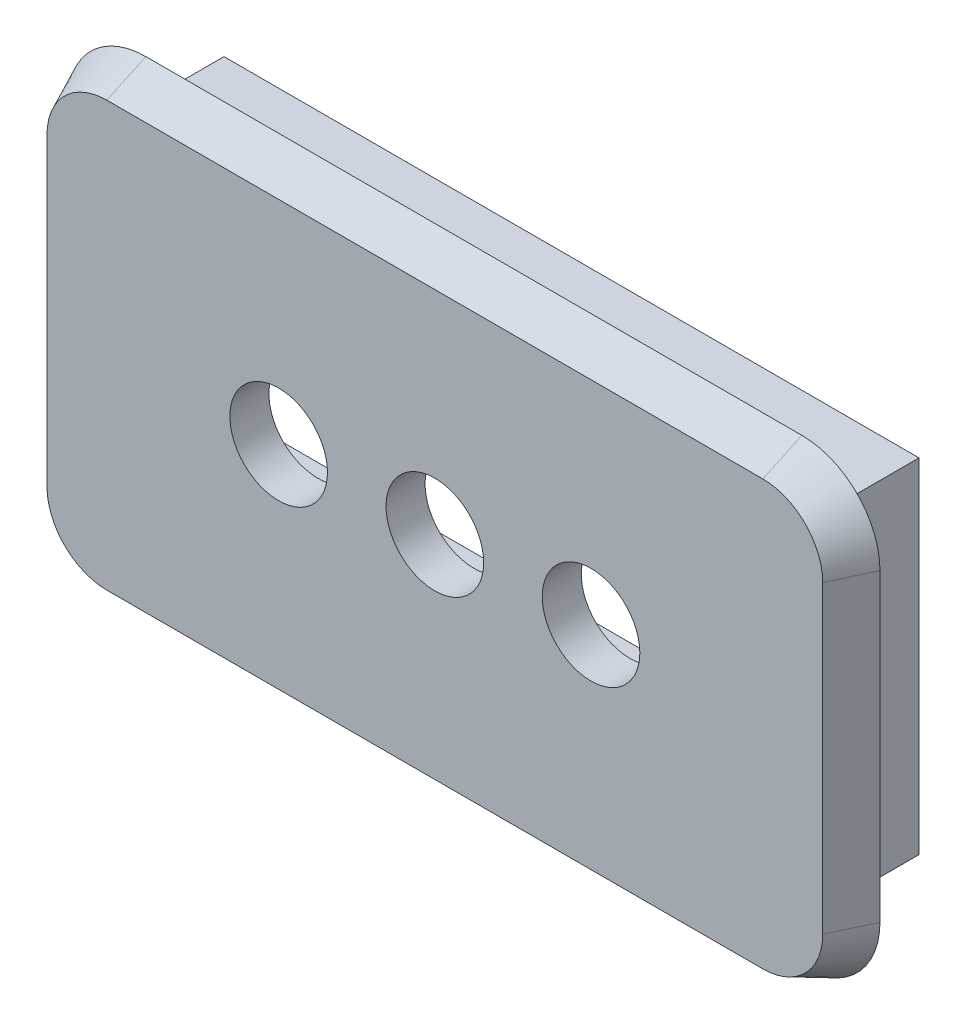
ISO-10303-21;
HEADER;
FILE_DESCRIPTION(('STEP AP214'),'2;1');
FILE_NAME('part.step','',(''),(''),'','','');
FILE_SCHEMA(('AUTOMOTIVE_DESIGN { 1 0 10303 214 1 1 1 1 }'));
ENDSEC;
DATA;
#1=APPLICATION_CONTEXT('core data for automotive mechanical design processes');
#2=APPLICATION_PROTOCOL_DEFINITION('international standard','automotive_design',2000,#1);
#3=PRODUCT_CONTEXT('',#1,'mechanical');
#4=PRODUCT('Part','Part','',(#3));
#5=PRODUCT_RELATED_PRODUCT_CATEGORY('part','',(#4));
#6=PRODUCT_DEFINITION_FORMATION('','',#4);
#7=PRODUCT_DEFINITION_CONTEXT('part definition',#1,'design');
#8=PRODUCT_DEFINITION('design','',#6,#7);
#9=PRODUCT_DEFINITION_SHAPE('','',#8);
#10=(LENGTH_UNIT() NAMED_UNIT(*) SI_UNIT(.MILLI.,.METRE.));
#11=(NAMED_UNIT(*) PLANE_ANGLE_UNIT() SI_UNIT($,.RADIAN.));
#12=(NAMED_UNIT(*) SI_UNIT($,.STERADIAN.) SOLID_ANGLE_UNIT());
#13=UNCERTAINTY_MEASURE_WITH_UNIT(LENGTH_MEASURE(1.E-05),#10,'distance_accuracy_value','');
#14=(GEOMETRIC_REPRESENTATION_CONTEXT(3) GLOBAL_UNCERTAINTY_ASSIGNED_CONTEXT((#13)) GLOBAL_UNIT_ASSIGNED_CONTEXT((#10,
#11,#12)) REPRESENTATION_CONTEXT('',''));
#15=CARTESIAN_POINT('',(0.,0.,0.));
#16=DIRECTION('',(0.,0.,1.));
#17=DIRECTION('',(1.,0.,0.));
#18=AXIS2_PLACEMENT_3D('',#15,#16,#17);
#19=CARTESIAN_POINT('',(9.33499999999989,29.9,-2.5));
#20=DIRECTION('',(0.,1.,0.));
#21=DIRECTION('',(0.,0.,1.));
#22=AXIS2_PLACEMENT_3D('',#19,#20,#21);
#23=PLANE('',#22);
#24=DIRECTION('',(-1.,0.,0.));
#25=VECTOR('',#24,1.);
#26=CARTESIAN_POINT('',(9.33499999999989,29.9,0.));
#27=LINE('',#26,#25);
#28=CARTESIAN_POINT('',(9.33499999999989,29.9,0.));
#29=VERTEX_POINT('',#28);
#30=CARTESIAN_POINT('',(-8.46500000000011,29.9,0.));
#31=VERTEX_POINT('',#30);
#32=EDGE_CURVE('E263',#29,#31,#27,.T.);
#33=ORIENTED_EDGE('',*,*,#32,.F.);
#34=DIRECTION('',(0.,0.,1.));
#35=VECTOR('',#34,1.);
#36=CARTESIAN_POINT('',(9.33499999999989,29.9,-2.5));
#37=LINE('',#36,#35);
#38=CARTESIAN_POINT('',(9.33499999999989,29.9,-2.5));
#39=VERTEX_POINT('',#38);
#40=EDGE_CURVE('E11',#39,#29,#37,.T.);
#41=ORIENTED_EDGE('',*,*,#40,.F.);
#42=DIRECTION('',(-1.,0.,0.));
#43=VECTOR('',#42,1.);
#44=CARTESIAN_POINT('',(9.33499999999989,29.9,-2.5));
#45=LINE('',#44,#43);
#46=CARTESIAN_POINT('',(-8.46500000000011,29.9,-2.5));
#47=VERTEX_POINT('',#46);
#48=EDGE_CURVE('E271',#39,#47,#45,.T.);
#49=ORIENTED_EDGE('',*,*,#48,.T.);
#50=DIRECTION('',(0.,0.,1.));
#51=VECTOR('',#50,1.);
#52=CARTESIAN_POINT('',(-8.46500000000011,29.9,-2.5));
#53=LINE('',#52,#51);
#54=EDGE_CURVE('E42',#47,#31,#53,.T.);
#55=ORIENTED_EDGE('',*,*,#54,.T.);
#56=EDGE_LOOP('',(#33,#41,#49,#55));
#57=FACE_BOUND('',#56,.T.);
#58=ADVANCED_FACE('F39',(#57),#23,.T.);
#59=CARTESIAN_POINT('',(9.33499999999988,21.1,-2.5));
#60=DIRECTION('',(1.,0.,0.));
#61=DIRECTION('',(0.,1.,0.));
#62=AXIS2_PLACEMENT_3D('',#59,#60,#61);
#63=PLANE('',#62);
#64=DIRECTION('',(0.,1.,0.));
#65=VECTOR('',#64,1.);
#66=CARTESIAN_POINT('',(9.33499999999988,21.1,0.));
#67=LINE('',#66,#65);
#68=CARTESIAN_POINT('',(9.33499999999988,21.1,0.));
#69=VERTEX_POINT('',#68);
#70=EDGE_CURVE('E274',#69,#29,#67,.T.);
#71=ORIENTED_EDGE('',*,*,#70,.F.);
#72=DIRECTION('',(0.,0.,1.));
#73=VECTOR('',#72,1.);
#74=CARTESIAN_POINT('',(9.33499999999988,21.1,-2.5));
#75=LINE('',#74,#73);
#76=CARTESIAN_POINT('',(9.33499999999988,21.1,-2.5));
#77=VERTEX_POINT('',#76);
#78=EDGE_CURVE('E47',#77,#69,#75,.T.);
#79=ORIENTED_EDGE('',*,*,#78,.F.);
#80=DIRECTION('',(0.,1.,0.));
#81=VECTOR('',#80,1.);
#82=CARTESIAN_POINT('',(9.33499999999988,21.1,-2.5));
#83=LINE('',#82,#81);
#84=EDGE_CURVE('E278',#77,#39,#83,.T.);
#85=ORIENTED_EDGE('',*,*,#84,.T.);
#86=ORIENTED_EDGE('',*,*,#40,.T.);
#87=EDGE_LOOP('',(#71,#79,#85,#86));
#88=FACE_BOUND('',#87,.T.);
#89=ADVANCED_FACE('F294',(#88),#63,.T.);
#90=CARTESIAN_POINT('',(-8.46500000000011,21.1,-2.5));
#91=DIRECTION('',(0.,-1.,0.));
#92=DIRECTION('',(0.,0.,-1.));
#93=AXIS2_PLACEMENT_3D('',#90,#91,#92);
#94=PLANE('',#93);
#95=DIRECTION('',(1.,0.,0.));
#96=VECTOR('',#95,1.);
#97=CARTESIAN_POINT('',(-8.46500000000011,21.1,0.));
#98=LINE('',#97,#96);
#99=CARTESIAN_POINT('',(-8.46500000000011,21.1,0.));
#100=VERTEX_POINT('',#99);
#101=EDGE_CURVE('E286',#100,#69,#98,.T.);
#102=ORIENTED_EDGE('',*,*,#101,.F.);
#103=DIRECTION('',(0.,0.,1.));
#104=VECTOR('',#103,1.);
#105=CARTESIAN_POINT('',(-8.46500000000011,21.1,-2.5));
#106=LINE('',#105,#104);
#107=CARTESIAN_POINT('',(-8.46500000000011,21.1,-2.5));
#108=VERTEX_POINT('',#107);
#109=EDGE_CURVE('E291',#108,#100,#106,.T.);
#110=ORIENTED_EDGE('',*,*,#109,.F.);
#111=DIRECTION('',(1.,0.,0.));
#112=VECTOR('',#111,1.);
#113=CARTESIAN_POINT('',(-8.46500000000011,21.1,-2.5));
#114=LINE('',#113,#112);
#115=EDGE_CURVE('E276',#108,#77,#114,.T.);
#116=ORIENTED_EDGE('',*,*,#115,.T.);
#117=ORIENTED_EDGE('',*,*,#78,.T.);
#118=EDGE_LOOP('',(#102,#110,#116,#117));
#119=FACE_BOUND('',#118,.T.);
#120=ADVANCED_FACE('F299',(#119),#94,.T.);
#121=CARTESIAN_POINT('',(-8.46500000000011,29.9,-2.5));
#122=DIRECTION('',(-1.,0.,0.));
#123=DIRECTION('',(0.,-1.,0.));
#124=AXIS2_PLACEMENT_3D('',#121,#122,#123);
#125=PLANE('',#124);
#126=DIRECTION('',(0.,-1.,0.));
#127=VECTOR('',#126,1.);
#128=CARTESIAN_POINT('',(-8.46500000000011,29.9,0.));
#129=LINE('',#128,#127);
#130=EDGE_CURVE('E283',#31,#100,#129,.T.);
#131=ORIENTED_EDGE('',*,*,#130,.F.);
#132=ORIENTED_EDGE('',*,*,#54,.F.);
#133=DIRECTION('',(0.,-1.,0.));
#134=VECTOR('',#133,1.);
#135=CARTESIAN_POINT('',(-8.46500000000011,29.9,-2.5));
#136=LINE('',#135,#134);
#137=EDGE_CURVE('E273',#47,#108,#136,.T.);
#138=ORIENTED_EDGE('',*,*,#137,.T.);
#139=ORIENTED_EDGE('',*,*,#109,.T.);
#140=EDGE_LOOP('',(#131,#132,#138,#139));
#141=FACE_BOUND('',#140,.T.);
#142=ADVANCED_FACE('F292',(#141),#125,.T.);
#143=CARTESIAN_POINT('',(0.,0.,-2.5));
#144=DIRECTION('',(0.,0.,1.));
#145=DIRECTION('',(1.,0.,0.));
#146=AXIS2_PLACEMENT_3D('',#143,#144,#145);
#147=PLANE('',#146);
#148=DIRECTION('',(0.,1.,0.));
#149=VECTOR('',#148,1.);
#150=CARTESIAN_POINT('',(8.33499999999988,22.1,-2.5));
#151=LINE('',#150,#149);
#152=CARTESIAN_POINT('',(8.33499999999988,22.1,-2.5));
#153=VERTEX_POINT('',#152);
#154=CARTESIAN_POINT('',(8.33499999999988,28.9,-2.5));
#155=VERTEX_POINT('',#154);
#156=EDGE_CURVE('E246',#153,#155,#151,.T.);
#157=ORIENTED_EDGE('',*,*,#156,.T.);
#158=DIRECTION('',(-1.,0.,0.));
#159=VECTOR('',#158,1.);
#160=CARTESIAN_POINT('',(8.33499999999988,28.9,-2.5));
#161=LINE('',#160,#159);
#162=CARTESIAN_POINT('',(-7.46500000000011,28.9,-2.5));
#163=VERTEX_POINT('',#162);
#164=EDGE_CURVE('E238',#155,#163,#161,.T.);
#165=ORIENTED_EDGE('',*,*,#164,.T.);
#166=DIRECTION('',(0.,-1.,0.));
#167=VECTOR('',#166,1.);
#168=CARTESIAN_POINT('',(-7.46500000000011,28.9,-2.5));
#169=LINE('',#168,#167);
#170=CARTESIAN_POINT('',(-7.46500000000011,22.1,-2.5));
#171=VERTEX_POINT('',#170);
#172=EDGE_CURVE('E241',#163,#171,#169,.T.);
#173=ORIENTED_EDGE('',*,*,#172,.T.);
#174=DIRECTION('',(1.,0.,0.));
#175=VECTOR('',#174,1.);
#176=CARTESIAN_POINT('',(-7.46500000000011,22.1,-2.5));
#177=LINE('',#176,#175);
#178=EDGE_CURVE('E55',#171,#153,#177,.T.);
#179=ORIENTED_EDGE('',*,*,#178,.T.);
#180=EDGE_LOOP('',(#157,#165,#173,#179));
#181=FACE_BOUND('',#180,.T.);
#182=ORIENTED_EDGE('',*,*,#48,.F.);
#183=ORIENTED_EDGE('',*,*,#84,.F.);
#184=ORIENTED_EDGE('',*,*,#115,.F.);
#185=ORIENTED_EDGE('',*,*,#137,.F.);
#186=EDGE_LOOP('',(#182,#183,#184,#185));
#187=FACE_BOUND('',#186,.T.);
#188=ADVANCED_FACE('F298',(#181,#187),#147,.F.);
#189=CARTESIAN_POINT('',(8.33499999999988,28.9,-2.5));
#190=DIRECTION('',(0.,1.,0.));
#191=DIRECTION('',(-1.,0.,0.));
#192=AXIS2_PLACEMENT_3D('',#189,#190,#191);
#193=PLANE('',#192);
#194=DIRECTION('',(-1.,0.,0.));
#195=VECTOR('',#194,1.);
#196=CARTESIAN_POINT('',(8.33499999999988,28.9,0.));
#197=LINE('',#196,#195);
#198=CARTESIAN_POINT('',(8.33499999999988,28.9,0.));
#199=VERTEX_POINT('',#198);
#200=CARTESIAN_POINT('',(-7.46500000000011,28.9,0.));
#201=VERTEX_POINT('',#200);
#202=EDGE_CURVE('E181',#199,#201,#197,.T.);
#203=ORIENTED_EDGE('',*,*,#202,.T.);
#204=DIRECTION('',(0.,0.,1.));
#205=VECTOR('',#204,1.);
#206=CARTESIAN_POINT('',(-7.46500000000011,28.9,-2.5));
#207=LINE('',#206,#205);
#208=EDGE_CURVE('E249',#163,#201,#207,.T.);
#209=ORIENTED_EDGE('',*,*,#208,.F.);
#210=ORIENTED_EDGE('',*,*,#164,.F.);
#211=DIRECTION('',(0.,0.,1.));
#212=VECTOR('',#211,1.);
#213=CARTESIAN_POINT('',(8.33499999999988,28.9,-2.5));
#214=LINE('',#213,#212);
#215=EDGE_CURVE('E260',#155,#199,#214,.T.);
#216=ORIENTED_EDGE('',*,*,#215,.T.);
#217=EDGE_LOOP('',(#203,#209,#210,#216));
#218=FACE_BOUND('',#217,.T.);
#219=ADVANCED_FACE('F335',(#218),#193,.F.);
#220=CARTESIAN_POINT('',(8.33499999999988,22.1,-2.5));
#221=DIRECTION('',(1.,0.,0.));
#222=DIRECTION('',(0.,1.,0.));
#223=AXIS2_PLACEMENT_3D('',#220,#221,#222);
#224=PLANE('',#223);
#225=DIRECTION('',(0.,1.,0.));
#226=VECTOR('',#225,1.);
#227=CARTESIAN_POINT('',(8.33499999999988,22.1,0.));
#228=LINE('',#227,#226);
#229=CARTESIAN_POINT('',(8.33499999999988,22.1,0.));
#230=VERTEX_POINT('',#229);
#231=EDGE_CURVE('E242',#230,#199,#228,.T.);
#232=ORIENTED_EDGE('',*,*,#231,.T.);
#233=ORIENTED_EDGE('',*,*,#215,.F.);
#234=ORIENTED_EDGE('',*,*,#156,.F.);
#235=DIRECTION('',(0.,0.,1.));
#236=VECTOR('',#235,1.);
#237=CARTESIAN_POINT('',(8.33499999999988,22.1,-2.5));
#238=LINE('',#237,#236);
#239=EDGE_CURVE('E264',#153,#230,#238,.T.);
#240=ORIENTED_EDGE('',*,*,#239,.T.);
#241=EDGE_LOOP('',(#232,#233,#234,#240));
#242=FACE_BOUND('',#241,.T.);
#243=ADVANCED_FACE('F340',(#242),#224,.F.);
#244=CARTESIAN_POINT('',(-7.46500000000011,22.1,-2.5));
#245=DIRECTION('',(0.,-1.,0.));
#246=DIRECTION('',(0.,0.,-1.));
#247=AXIS2_PLACEMENT_3D('',#244,#245,#246);
#248=PLANE('',#247);
#249=DIRECTION('',(1.,0.,0.));
#250=VECTOR('',#249,1.);
#251=CARTESIAN_POINT('',(-7.46500000000011,22.1,0.));
#252=LINE('',#251,#250);
#253=CARTESIAN_POINT('',(-7.46500000000011,22.1,0.));
#254=VERTEX_POINT('',#253);
#255=EDGE_CURVE('E255',#254,#230,#252,.T.);
#256=ORIENTED_EDGE('',*,*,#255,.T.);
#257=ORIENTED_EDGE('',*,*,#239,.F.);
#258=ORIENTED_EDGE('',*,*,#178,.F.);
#259=DIRECTION('',(0.,0.,1.));
#260=VECTOR('',#259,1.);
#261=CARTESIAN_POINT('',(-7.46500000000011,22.1,-2.5));
#262=LINE('',#261,#260);
#263=EDGE_CURVE('E267',#171,#254,#262,.T.);
#264=ORIENTED_EDGE('',*,*,#263,.T.);
#265=EDGE_LOOP('',(#256,#257,#258,#264));
#266=FACE_BOUND('',#265,.T.);
#267=ADVANCED_FACE('F351',(#266),#248,.F.);
#268=CARTESIAN_POINT('',(-7.46500000000011,28.9,-2.5));
#269=DIRECTION('',(-1.,0.,0.));
#270=DIRECTION('',(0.,0.,1.));
#271=AXIS2_PLACEMENT_3D('',#268,#269,#270);
#272=PLANE('',#271);
#273=DIRECTION('',(0.,-1.,0.));
#274=VECTOR('',#273,1.);
#275=CARTESIAN_POINT('',(-7.46500000000011,28.9,0.));
#276=LINE('',#275,#274);
#277=EDGE_CURVE('E252',#201,#254,#276,.T.);
#278=ORIENTED_EDGE('',*,*,#277,.T.);
#279=ORIENTED_EDGE('',*,*,#263,.F.);
#280=ORIENTED_EDGE('',*,*,#172,.F.);
#281=ORIENTED_EDGE('',*,*,#208,.T.);
#282=EDGE_LOOP('',(#278,#279,#280,#281));
#283=FACE_BOUND('',#282,.T.);
#284=ADVANCED_FACE('F362',(#283),#272,.F.);
#285=CARTESIAN_POINT('',(8.83499999999989,29.4,1.));
#286=DIRECTION('',(0.,0.,1.));
#287=DIRECTION('',(1.,0.,0.));
#288=AXIS2_PLACEMENT_3D('',#285,#286,#287);
#289=PLANE('',#288);
#290=CARTESIAN_POINT('',(4.43499999999989,25.5,1.));
#291=DIRECTION('',(0.,0.,1.));
#292=DIRECTION('',(1.,0.,0.));
#293=AXIS2_PLACEMENT_3D('',#290,#291,#292);
#294=CIRCLE('',#293,1.25);
#295=CARTESIAN_POINT('',(5.68499999999989,25.5,1.));
#296=VERTEX_POINT('',#295);
#297=EDGE_CURVE('E564',#296,#296,#294,.T.);
#298=ORIENTED_EDGE('',*,*,#297,.F.);
#299=EDGE_LOOP('',(#298));
#300=FACE_BOUND('',#299,.T.);
#301=CARTESIAN_POINT('',(-3.56500000000011,25.5,1.));
#302=DIRECTION('',(0.,0.,1.));
#303=DIRECTION('',(1.,0.,0.));
#304=AXIS2_PLACEMENT_3D('',#301,#302,#303);
#305=CIRCLE('',#304,1.25);
#306=CARTESIAN_POINT('',(-2.31500000000011,25.5,1.));
#307=VERTEX_POINT('',#306);
#308=EDGE_CURVE('E572',#307,#307,#305,.T.);
#309=ORIENTED_EDGE('',*,*,#308,.F.);
#310=EDGE_LOOP('',(#309));
#311=FACE_BOUND('',#310,.T.);
#312=CARTESIAN_POINT('',(0.434999999999888,25.5,1.));
#313=DIRECTION('',(0.,0.,1.));
#314=DIRECTION('',(1.,0.,0.));
#315=AXIS2_PLACEMENT_3D('',#312,#313,#314);
#316=CIRCLE('',#315,1.25);
#317=CARTESIAN_POINT('',(1.68499999999989,25.5,1.));
#318=VERTEX_POINT('',#317);
#319=EDGE_CURVE('E191',#318,#318,#316,.T.);
#320=ORIENTED_EDGE('',*,*,#319,.F.);
#321=EDGE_LOOP('',(#320));
#322=FACE_BOUND('',#321,.T.);
#323=CARTESIAN_POINT('',(8.83499999999989,29.4,1.));
#324=DIRECTION('',(0.,0.,1.));
#325=DIRECTION('',(1.,0.,0.));
#326=AXIS2_PLACEMENT_3D('',#323,#324,#325);
#327=CIRCLE('',#326,1.533692341845);
#328=CARTESIAN_POINT('',(10.3686923418449,29.4,1.));
#329=VERTEX_POINT('',#328);
#330=CARTESIAN_POINT('',(8.83499999999989,30.933692341845,1.));
#331=VERTEX_POINT('',#330);
#332=EDGE_CURVE('E205',#329,#331,#327,.T.);
#333=ORIENTED_EDGE('',*,*,#332,.T.);
#334=DIRECTION('',(1.,0.,0.));
#335=VECTOR('',#334,1.);
#336=CARTESIAN_POINT('',(8.83499999999989,30.933692341845,1.));
#337=LINE('',#336,#335);
#338=CARTESIAN_POINT('',(-7.96500000000011,30.933692341845,1.));
#339=VERTEX_POINT('',#338);
#340=EDGE_CURVE('E177',#331,#339,#337,.F.);
#341=ORIENTED_EDGE('',*,*,#340,.T.);
#342=CARTESIAN_POINT('',(-7.96500000000011,29.4,1.));
#343=DIRECTION('',(0.,0.,1.));
#344=DIRECTION('',(1.,0.,0.));
#345=AXIS2_PLACEMENT_3D('',#342,#343,#344);
#346=CIRCLE('',#345,1.533692341845);
#347=CARTESIAN_POINT('',(-9.49869234184511,29.4,1.));
#348=VERTEX_POINT('',#347);
#349=EDGE_CURVE('E227',#339,#348,#346,.T.);
#350=ORIENTED_EDGE('',*,*,#349,.T.);
#351=DIRECTION('',(0.,1.,0.));
#352=VECTOR('',#351,1.);
#353=CARTESIAN_POINT('',(-9.49869234184511,29.4,1.));
#354=LINE('',#353,#352);
#355=CARTESIAN_POINT('',(-9.49869234184511,21.6,1.));
#356=VERTEX_POINT('',#355);
#357=EDGE_CURVE('E229',#348,#356,#354,.F.);
#358=ORIENTED_EDGE('',*,*,#357,.T.);
#359=CARTESIAN_POINT('',(-7.96500000000011,21.6,1.));
#360=DIRECTION('',(0.,0.,1.));
#361=DIRECTION('',(1.,0.,0.));
#362=AXIS2_PLACEMENT_3D('',#359,#360,#361);
#363=CIRCLE('',#362,1.533692341845);
#364=CARTESIAN_POINT('',(-7.96500000000009,20.066307658155,1.));
#365=VERTEX_POINT('',#364);
#366=EDGE_CURVE('E231',#356,#365,#363,.T.);
#367=ORIENTED_EDGE('',*,*,#366,.T.);
#368=DIRECTION('',(-1.,0.,0.));
#369=VECTOR('',#368,1.);
#370=CARTESIAN_POINT('',(-7.96500000000009,20.066307658155,1.));
#371=LINE('',#370,#369);
#372=CARTESIAN_POINT('',(8.83499999999987,20.066307658155,1.));
#373=VERTEX_POINT('',#372);
#374=EDGE_CURVE('E233',#365,#373,#371,.F.);
#375=ORIENTED_EDGE('',*,*,#374,.T.);
#376=CARTESIAN_POINT('',(8.83499999999988,21.6,1.));
#377=DIRECTION('',(0.,0.,1.));
#378=DIRECTION('',(1.,0.,0.));
#379=AXIS2_PLACEMENT_3D('',#376,#377,#378);
#380=CIRCLE('',#379,1.533692341845);
#381=CARTESIAN_POINT('',(10.3686923418449,21.6,1.));
#382=VERTEX_POINT('',#381);
#383=EDGE_CURVE('E235',#373,#382,#380,.T.);
#384=ORIENTED_EDGE('',*,*,#383,.T.);
#385=DIRECTION('',(0.,-1.,0.));
#386=VECTOR('',#385,1.);
#387=CARTESIAN_POINT('',(10.3686923418449,21.6,1.));
#388=LINE('',#387,#386);
#389=EDGE_CURVE('E209',#382,#329,#388,.F.);
#390=ORIENTED_EDGE('',*,*,#389,.T.);
#391=EDGE_LOOP('',(#333,#341,#350,#358,#367,#375,#384,#390));
#392=FACE_BOUND('',#391,.T.);
#393=ADVANCED_FACE('F372',(#300,#311,#322,#392),#289,.T.);
#394=CARTESIAN_POINT('',(10.8349999999999,21.6,0.));
#395=DIRECTION('',(0.90630778703665,0.,0.4226182617407));
#396=DIRECTION('',(0.4226182617407,0.,-0.90630778703665));
#397=AXIS2_PLACEMENT_3D('',#394,#395,#396);
#398=PLANE('',#397);
#399=DIRECTION('',(0.,1.,0.));
#400=VECTOR('',#399,1.);
#401=CARTESIAN_POINT('',(10.8349999999999,21.6,0.));
#402=LINE('',#401,#400);
#403=CARTESIAN_POINT('',(10.8349999999999,21.6,0.));
#404=VERTEX_POINT('',#403);
#405=CARTESIAN_POINT('',(10.8349999999999,29.4,0.));
#406=VERTEX_POINT('',#405);
#407=EDGE_CURVE('E204',#404,#406,#402,.T.);
#408=ORIENTED_EDGE('',*,*,#407,.T.);
#409=DIRECTION('',(0.4226182617407,0.,-0.90630778703665));
#410=VECTOR('',#409,1.);
#411=CARTESIAN_POINT('',(10.8349999999999,29.4,0.));
#412=LINE('',#411,#410);
#413=EDGE_CURVE('E187',#329,#406,#412,.T.);
#414=ORIENTED_EDGE('',*,*,#413,.F.);
#415=ORIENTED_EDGE('',*,*,#389,.F.);
#416=DIRECTION('',(0.4226182617407,0.,-0.90630778703665));
#417=VECTOR('',#416,1.);
#418=CARTESIAN_POINT('',(10.8349999999999,21.6,0.));
#419=LINE('',#418,#417);
#420=EDGE_CURVE('E208',#382,#404,#419,.T.);
#421=ORIENTED_EDGE('',*,*,#420,.T.);
#422=EDGE_LOOP('',(#408,#414,#415,#421));
#423=FACE_BOUND('',#422,.T.);
#424=ADVANCED_FACE('F381',(#423),#398,.T.);
#425=CARTESIAN_POINT('',(8.83499999999988,21.6,0.));
#426=DIRECTION('',(0.,0.,-1.));
#427=DIRECTION('',(-1.,0.,0.));
#428=AXIS2_PLACEMENT_3D('',#425,#426,#427);
#429=CONICAL_SURFACE('',#428,2.,0.436332312998583);
#430=CARTESIAN_POINT('',(8.83499999999988,21.6,0.));
#431=DIRECTION('',(0.,0.,1.));
#432=DIRECTION('',(-1.,0.,0.));
#433=AXIS2_PLACEMENT_3D('',#430,#431,#432);
#434=CIRCLE('',#433,2.);
#435=CARTESIAN_POINT('',(8.83499999999987,19.6,0.));
#436=VERTEX_POINT('',#435);
#437=EDGE_CURVE('E202',#436,#404,#434,.T.);
#438=ORIENTED_EDGE('',*,*,#437,.T.);
#439=ORIENTED_EDGE('',*,*,#420,.F.);
#440=ORIENTED_EDGE('',*,*,#383,.F.);
#441=DIRECTION('',(0.,-0.4226182617407,-0.90630778703665));
#442=VECTOR('',#441,1.);
#443=CARTESIAN_POINT('',(8.83499999999987,19.6,0.));
#444=LINE('',#443,#442);
#445=EDGE_CURVE('E212',#373,#436,#444,.T.);
#446=ORIENTED_EDGE('',*,*,#445,.T.);
#447=EDGE_LOOP('',(#438,#439,#440,#446));
#448=FACE_BOUND('',#447,.T.);
#449=ADVANCED_FACE('F386',(#448),#429,.T.);
#450=CARTESIAN_POINT('',(-7.96500000000009,19.6,0.));
#451=DIRECTION('',(0.,-0.90630778703665,0.4226182617407));
#452=DIRECTION('',(0.,-0.4226182617407,-0.90630778703665));
#453=AXIS2_PLACEMENT_3D('',#450,#451,#452);
#454=PLANE('',#453);
#455=DIRECTION('',(1.,0.,0.));
#456=VECTOR('',#455,1.);
#457=CARTESIAN_POINT('',(-7.96500000000009,19.6,0.));
#458=LINE('',#457,#456);
#459=CARTESIAN_POINT('',(-7.96500000000009,19.6,0.));
#460=VERTEX_POINT('',#459);
#461=EDGE_CURVE('E200',#460,#436,#458,.T.);
#462=ORIENTED_EDGE('',*,*,#461,.T.);
#463=ORIENTED_EDGE('',*,*,#445,.F.);
#464=ORIENTED_EDGE('',*,*,#374,.F.);
#465=DIRECTION('',(0.,-0.4226182617407,-0.90630778703665));
#466=VECTOR('',#465,1.);
#467=CARTESIAN_POINT('',(-7.96500000000009,19.6,0.));
#468=LINE('',#467,#466);
#469=EDGE_CURVE('E215',#365,#460,#468,.T.);
#470=ORIENTED_EDGE('',*,*,#469,.T.);
#471=EDGE_LOOP('',(#462,#463,#464,#470));
#472=FACE_BOUND('',#471,.T.);
#473=ADVANCED_FACE('F397',(#472),#454,.T.);
#474=CARTESIAN_POINT('',(-7.96500000000011,21.6,0.));
#475=DIRECTION('',(0.,0.,-1.));
#476=DIRECTION('',(-1.,0.,0.));
#477=AXIS2_PLACEMENT_3D('',#474,#475,#476);
#478=CONICAL_SURFACE('',#477,2.,0.436332312998583);
#479=CARTESIAN_POINT('',(-7.96500000000011,21.6,0.));
#480=DIRECTION('',(0.,0.,1.));
#481=DIRECTION('',(-1.,0.,0.));
#482=AXIS2_PLACEMENT_3D('',#479,#480,#481);
#483=CIRCLE('',#482,2.);
#484=CARTESIAN_POINT('',(-9.96500000000011,21.6,0.));
#485=VERTEX_POINT('',#484);
#486=EDGE_CURVE('E198',#485,#460,#483,.T.);
#487=ORIENTED_EDGE('',*,*,#486,.T.);
#488=ORIENTED_EDGE('',*,*,#469,.F.);
#489=ORIENTED_EDGE('',*,*,#366,.F.);
#490=DIRECTION('',(-0.4226182617407,0.,-0.90630778703665));
#491=VECTOR('',#490,1.);
#492=CARTESIAN_POINT('',(-9.96500000000011,21.6,0.));
#493=LINE('',#492,#491);
#494=EDGE_CURVE('E218',#356,#485,#493,.T.);
#495=ORIENTED_EDGE('',*,*,#494,.T.);
#496=EDGE_LOOP('',(#487,#488,#489,#495));
#497=FACE_BOUND('',#496,.T.);
#498=ADVANCED_FACE('F408',(#497),#478,.T.);
#499=CARTESIAN_POINT('',(-9.96500000000011,29.4,0.));
#500=DIRECTION('',(-0.90630778703665,0.,0.4226182617407));
#501=DIRECTION('',(0.4226182617407,0.,0.90630778703665));
#502=AXIS2_PLACEMENT_3D('',#499,#500,#501);
#503=PLANE('',#502);
#504=DIRECTION('',(0.,-1.,0.));
#505=VECTOR('',#504,1.);
#506=CARTESIAN_POINT('',(-9.96500000000011,29.4,0.));
#507=LINE('',#506,#505);
#508=CARTESIAN_POINT('',(-9.96500000000011,29.4,0.));
#509=VERTEX_POINT('',#508);
#510=EDGE_CURVE('E196',#509,#485,#507,.T.);
#511=ORIENTED_EDGE('',*,*,#510,.T.);
#512=ORIENTED_EDGE('',*,*,#494,.F.);
#513=ORIENTED_EDGE('',*,*,#357,.F.);
#514=DIRECTION('',(-0.4226182617407,0.,-0.90630778703665));
#515=VECTOR('',#514,1.);
#516=CARTESIAN_POINT('',(-9.96500000000011,29.4,0.));
#517=LINE('',#516,#515);
#518=EDGE_CURVE('E221',#348,#509,#517,.T.);
#519=ORIENTED_EDGE('',*,*,#518,.T.);
#520=EDGE_LOOP('',(#511,#512,#513,#519));
#521=FACE_BOUND('',#520,.T.);
#522=ADVANCED_FACE('F419',(#521),#503,.T.);
#523=CARTESIAN_POINT('',(-7.96500000000011,29.4,0.));
#524=DIRECTION('',(0.,0.,-1.));
#525=DIRECTION('',(-1.,0.,0.));
#526=AXIS2_PLACEMENT_3D('',#523,#524,#525);
#527=CONICAL_SURFACE('',#526,2.,0.436332312998583);
#528=CARTESIAN_POINT('',(-7.96500000000011,29.4,0.));
#529=DIRECTION('',(0.,0.,1.));
#530=DIRECTION('',(-1.,0.,0.));
#531=AXIS2_PLACEMENT_3D('',#528,#529,#530);
#532=CIRCLE('',#531,2.);
#533=CARTESIAN_POINT('',(-7.96500000000011,31.4,0.));
#534=VERTEX_POINT('',#533);
#535=EDGE_CURVE('E169',#534,#509,#532,.T.);
#536=ORIENTED_EDGE('',*,*,#535,.T.);
#537=ORIENTED_EDGE('',*,*,#518,.F.);
#538=ORIENTED_EDGE('',*,*,#349,.F.);
#539=DIRECTION('',(0.,0.4226182617407,-0.90630778703665));
#540=VECTOR('',#539,1.);
#541=CARTESIAN_POINT('',(-7.96500000000011,31.4,0.));
#542=LINE('',#541,#540);
#543=EDGE_CURVE('E182',#339,#534,#542,.T.);
#544=ORIENTED_EDGE('',*,*,#543,.T.);
#545=EDGE_LOOP('',(#536,#537,#538,#544));
#546=FACE_BOUND('',#545,.T.);
#547=ADVANCED_FACE('F430',(#546),#527,.T.);
#548=CARTESIAN_POINT('',(8.83499999999989,31.4,0.));
#549=DIRECTION('',(0.,0.90630778703665,0.4226182617407));
#550=DIRECTION('',(0.,-0.4226182617407,0.90630778703665));
#551=AXIS2_PLACEMENT_3D('',#548,#549,#550);
#552=PLANE('',#551);
#553=DIRECTION('',(-1.,0.,0.));
#554=VECTOR('',#553,1.);
#555=CARTESIAN_POINT('',(8.83499999999989,31.4,0.));
#556=LINE('',#555,#554);
#557=CARTESIAN_POINT('',(8.83499999999989,31.4,0.));
#558=VERTEX_POINT('',#557);
#559=EDGE_CURVE('E161',#558,#534,#556,.T.);
#560=ORIENTED_EDGE('',*,*,#559,.T.);
#561=ORIENTED_EDGE('',*,*,#543,.F.);
#562=ORIENTED_EDGE('',*,*,#340,.F.);
#563=DIRECTION('',(0.,0.4226182617407,-0.90630778703665));
#564=VECTOR('',#563,1.);
#565=CARTESIAN_POINT('',(8.83499999999989,31.4,0.));
#566=LINE('',#565,#564);
#567=EDGE_CURVE('E175',#331,#558,#566,.T.);
#568=ORIENTED_EDGE('',*,*,#567,.T.);
#569=EDGE_LOOP('',(#560,#561,#562,#568));
#570=FACE_BOUND('',#569,.T.);
#571=ADVANCED_FACE('F176',(#570),#552,.T.);
#572=CARTESIAN_POINT('',(8.83499999999989,29.4,0.));
#573=DIRECTION('',(0.,0.,-1.));
#574=DIRECTION('',(1.,0.,0.));
#575=AXIS2_PLACEMENT_3D('',#572,#573,#574);
#576=CONICAL_SURFACE('',#575,2.,0.436332312998583);
#577=CARTESIAN_POINT('',(8.83499999999989,29.4,0.));
#578=DIRECTION('',(0.,0.,1.));
#579=DIRECTION('',(1.,0.,0.));
#580=AXIS2_PLACEMENT_3D('',#577,#578,#579);
#581=CIRCLE('',#580,2.);
#582=EDGE_CURVE('E167',#406,#558,#581,.T.);
#583=ORIENTED_EDGE('',*,*,#582,.T.);
#584=ORIENTED_EDGE('',*,*,#567,.F.);
#585=ORIENTED_EDGE('',*,*,#332,.F.);
#586=ORIENTED_EDGE('',*,*,#413,.T.);
#587=EDGE_LOOP('',(#583,#584,#585,#586));
#588=FACE_BOUND('',#587,.T.);
#589=ADVANCED_FACE('F185',(#588),#576,.T.);
#590=CARTESIAN_POINT('',(8.83499999999989,29.4,0.));
#591=DIRECTION('',(0.,0.,1.));
#592=DIRECTION('',(1.,0.,0.));
#593=AXIS2_PLACEMENT_3D('',#590,#591,#592);
#594=PLANE('',#593);
#595=ORIENTED_EDGE('',*,*,#582,.F.);
#596=ORIENTED_EDGE('',*,*,#407,.F.);
#597=ORIENTED_EDGE('',*,*,#437,.F.);
#598=ORIENTED_EDGE('',*,*,#461,.F.);
#599=ORIENTED_EDGE('',*,*,#486,.F.);
#600=ORIENTED_EDGE('',*,*,#510,.F.);
#601=ORIENTED_EDGE('',*,*,#535,.F.);
#602=ORIENTED_EDGE('',*,*,#559,.F.);
#603=EDGE_LOOP('',(#595,#596,#597,#598,#599,#600,#601,#602));
#604=FACE_BOUND('',#603,.T.);
#605=ORIENTED_EDGE('',*,*,#70,.T.);
#606=ORIENTED_EDGE('',*,*,#32,.T.);
#607=ORIENTED_EDGE('',*,*,#130,.T.);
#608=ORIENTED_EDGE('',*,*,#101,.T.);
#609=EDGE_LOOP('',(#605,#606,#607,#608));
#610=FACE_BOUND('',#609,.T.);
#611=ADVANCED_FACE('F163',(#604,#610),#594,.F.);
#612=CARTESIAN_POINT('',(4.43499999999989,25.5,0.));
#613=DIRECTION('',(0.,0.,1.));
#614=DIRECTION('',(1.,0.,0.));
#615=AXIS2_PLACEMENT_3D('',#612,#613,#614);
#616=CIRCLE('',#615,1.25);
#617=CARTESIAN_POINT('',(5.68499999999989,25.5,0.));
#618=VERTEX_POINT('',#617);
#619=EDGE_CURVE('E567',#618,#618,#616,.F.);
#620=ORIENTED_EDGE('',*,*,#619,.F.);
#621=EDGE_LOOP('',(#620));
#622=FACE_BOUND('',#621,.T.);
#623=CARTESIAN_POINT('',(-3.56500000000011,25.5,0.));
#624=DIRECTION('',(0.,0.,1.));
#625=DIRECTION('',(1.,0.,0.));
#626=AXIS2_PLACEMENT_3D('',#623,#624,#625);
#627=CIRCLE('',#626,1.25);
#628=CARTESIAN_POINT('',(-2.31500000000011,25.5,0.));
#629=VERTEX_POINT('',#628);
#630=EDGE_CURVE('E569',#629,#629,#627,.F.);
#631=ORIENTED_EDGE('',*,*,#630,.F.);
#632=EDGE_LOOP('',(#631));
#633=FACE_BOUND('',#632,.T.);
#634=CARTESIAN_POINT('',(0.434999999999888,25.5,0.));
#635=DIRECTION('',(0.,0.,1.));
#636=DIRECTION('',(1.,0.,0.));
#637=AXIS2_PLACEMENT_3D('',#634,#635,#636);
#638=CIRCLE('',#637,1.25);
#639=CARTESIAN_POINT('',(1.68499999999989,25.5,0.));
#640=VERTEX_POINT('',#639);
#641=EDGE_CURVE('E188',#640,#640,#638,.F.);
#642=ORIENTED_EDGE('',*,*,#641,.F.);
#643=EDGE_LOOP('',(#642));
#644=FACE_BOUND('',#643,.T.);
#645=ORIENTED_EDGE('',*,*,#202,.F.);
#646=ORIENTED_EDGE('',*,*,#231,.F.);
#647=ORIENTED_EDGE('',*,*,#255,.F.);
#648=ORIENTED_EDGE('',*,*,#277,.F.);
#649=EDGE_LOOP('',(#645,#646,#647,#648));
#650=FACE_BOUND('',#649,.T.);
#651=ADVANCED_FACE('F469',(#622,#633,#644,#650),#594,.F.);
#652=CARTESIAN_POINT('',(0.434999999999888,25.5,-2.501));
#653=DIRECTION('',(0.,0.,1.));
#654=DIRECTION('',(1.,0.,0.));
#655=AXIS2_PLACEMENT_3D('',#652,#653,#654);
#656=CYLINDRICAL_SURFACE('',#655,1.25);
#657=ORIENTED_EDGE('',*,*,#319,.T.);
#658=EDGE_LOOP('',(#657));
#659=FACE_BOUND('',#658,.T.);
#660=ORIENTED_EDGE('',*,*,#641,.T.);
#661=EDGE_LOOP('',(#660));
#662=FACE_BOUND('',#661,.T.);
#663=ADVANCED_FACE('F487',(#659,#662),#656,.F.);
#664=CARTESIAN_POINT('',(-3.56500000000011,25.5,-2.501));
#665=DIRECTION('',(0.,0.,1.));
#666=DIRECTION('',(1.,0.,0.));
#667=AXIS2_PLACEMENT_3D('',#664,#665,#666);
#668=CYLINDRICAL_SURFACE('',#667,1.25);
#669=ORIENTED_EDGE('',*,*,#308,.T.);
#670=EDGE_LOOP('',(#669));
#671=FACE_BOUND('',#670,.T.);
#672=ORIENTED_EDGE('',*,*,#630,.T.);
#673=EDGE_LOOP('',(#672));
#674=FACE_BOUND('',#673,.T.);
#675=ADVANCED_FACE('F497',(#671,#674),#668,.F.);
#676=CARTESIAN_POINT('',(4.43499999999989,25.5,-2.501));
#677=DIRECTION('',(0.,0.,1.));
#678=DIRECTION('',(1.,0.,0.));
#679=AXIS2_PLACEMENT_3D('',#676,#677,#678);
#680=CYLINDRICAL_SURFACE('',#679,1.25);
#681=ORIENTED_EDGE('',*,*,#297,.T.);
#682=EDGE_LOOP('',(#681));
#683=FACE_BOUND('',#682,.T.);
#684=ORIENTED_EDGE('',*,*,#619,.T.);
#685=EDGE_LOOP('',(#684));
#686=FACE_BOUND('',#685,.T.);
#687=ADVANCED_FACE('F508',(#683,#686),#680,.F.);
#688=CLOSED_SHELL('',(#58,#89,#120,#142,#188,#219,#243,#267,#284,#393,#424,#449,#473,#498,#522,
#547,#571,#589,#611,#651,#663,#675,#687));
#689=MANIFOLD_SOLID_BREP('B2',#688);
#690=ADVANCED_BREP_SHAPE_REPRESENTATION('',(#18,#689),#14);
#691=SHAPE_DEFINITION_REPRESENTATION(#9,#690);
ENDSEC;
END-ISO-10303-21;
